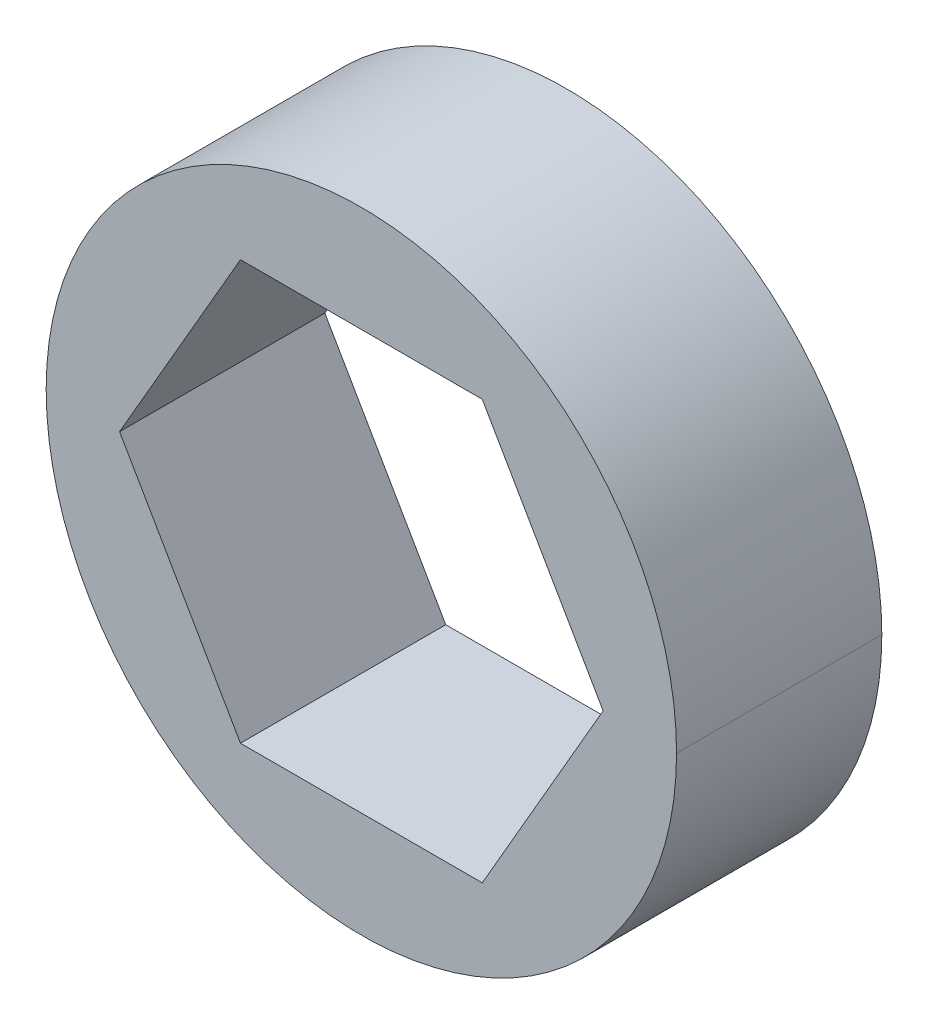
ISO-10303-21;
HEADER;
FILE_DESCRIPTION(('STEP AP214'),'2;1');
FILE_NAME('part.step','',(''),(''),'','','');
FILE_SCHEMA(('AUTOMOTIVE_DESIGN { 1 0 10303 214 1 1 1 1 }'));
ENDSEC;
DATA;
#1=APPLICATION_CONTEXT('core data for automotive mechanical design processes');
#2=APPLICATION_PROTOCOL_DEFINITION('international standard','automotive_design',2000,#1);
#3=PRODUCT_CONTEXT('',#1,'mechanical');
#4=PRODUCT('Part','Part','',(#3));
#5=PRODUCT_RELATED_PRODUCT_CATEGORY('part','',(#4));
#6=PRODUCT_DEFINITION_FORMATION('','',#4);
#7=PRODUCT_DEFINITION_CONTEXT('part definition',#1,'design');
#8=PRODUCT_DEFINITION('design','',#6,#7);
#9=PRODUCT_DEFINITION_SHAPE('','',#8);
#10=(LENGTH_UNIT() NAMED_UNIT(*) SI_UNIT(.MILLI.,.METRE.));
#11=(NAMED_UNIT(*) PLANE_ANGLE_UNIT() SI_UNIT($,.RADIAN.));
#12=(NAMED_UNIT(*) SI_UNIT($,.STERADIAN.) SOLID_ANGLE_UNIT());
#13=UNCERTAINTY_MEASURE_WITH_UNIT(LENGTH_MEASURE(1.E-05),#10,'distance_accuracy_value','');
#14=(GEOMETRIC_REPRESENTATION_CONTEXT(3) GLOBAL_UNCERTAINTY_ASSIGNED_CONTEXT((#13)) GLOBAL_UNIT_ASSIGNED_CONTEXT((#10,
#11,#12)) REPRESENTATION_CONTEXT('',''));
#15=CARTESIAN_POINT('',(0.,0.,0.));
#16=DIRECTION('',(0.,0.,1.));
#17=DIRECTION('',(1.,0.,0.));
#18=AXIS2_PLACEMENT_3D('',#15,#16,#17);
#19=CARTESIAN_POINT('',(-7.47899538708241,0.,3.175));
#20=DIRECTION('',(0.866025403784439,0.5,0.));
#21=DIRECTION('',(0.,0.,-1.));
#22=AXIS2_PLACEMENT_3D('',#19,#20,#21);
#23=PLANE('',#22);
#24=DIRECTION('',(0.5,-0.866025403784439,0.));
#25=VECTOR('',#24,1.);
#26=CARTESIAN_POINT('',(-7.47899538708241,0.,-3.175));
#27=LINE('',#26,#25);
#28=CARTESIAN_POINT('',(-7.47899538708241,0.,-3.175));
#29=VERTEX_POINT('',#28);
#30=CARTESIAN_POINT('',(-3.73949769354121,-6.477,-3.175));
#31=VERTEX_POINT('',#30);
#32=EDGE_CURVE('E102',#29,#31,#27,.T.);
#33=ORIENTED_EDGE('',*,*,#32,.F.);
#34=DIRECTION('',(0.,0.,-1.));
#35=VECTOR('',#34,1.);
#36=CARTESIAN_POINT('',(-7.47899538708241,0.,3.175));
#37=LINE('',#36,#35);
#38=CARTESIAN_POINT('',(-7.47899538708242,0.,3.175));
#39=VERTEX_POINT('',#38);
#40=EDGE_CURVE('E11',#39,#29,#37,.T.);
#41=ORIENTED_EDGE('',*,*,#40,.F.);
#42=DIRECTION('',(0.5,-0.866025403784439,0.));
#43=VECTOR('',#42,1.);
#44=CARTESIAN_POINT('',(-7.47899538708241,0.,3.175));
#45=LINE('',#44,#43);
#46=CARTESIAN_POINT('',(-3.7394976935412,-6.477,3.175));
#47=VERTEX_POINT('',#46);
#48=EDGE_CURVE('E105',#39,#47,#45,.T.);
#49=ORIENTED_EDGE('',*,*,#48,.T.);
#50=DIRECTION('',(0.,0.,-1.));
#51=VECTOR('',#50,1.);
#52=CARTESIAN_POINT('',(-3.7394976935412,-6.477,3.175));
#53=LINE('',#52,#51);
#54=EDGE_CURVE('E100',#47,#31,#53,.T.);
#55=ORIENTED_EDGE('',*,*,#54,.T.);
#56=EDGE_LOOP('',(#33,#41,#49,#55));
#57=FACE_BOUND('',#56,.T.);
#58=ADVANCED_FACE('F16',(#57),#23,.T.);
#59=CARTESIAN_POINT('',(-3.73949769354121,6.477,3.175));
#60=DIRECTION('',(0.866025403784439,-0.5,0.));
#61=DIRECTION('',(0.,0.,-1.));
#62=AXIS2_PLACEMENT_3D('',#59,#60,#61);
#63=PLANE('',#62);
#64=DIRECTION('',(-0.5,-0.866025403784439,0.));
#65=VECTOR('',#64,1.);
#66=CARTESIAN_POINT('',(-3.73949769354121,6.477,-3.175));
#67=LINE('',#66,#65);
#68=CARTESIAN_POINT('',(-3.73949769354121,6.477,-3.175));
#69=VERTEX_POINT('',#68);
#70=EDGE_CURVE('E120',#69,#29,#67,.T.);
#71=ORIENTED_EDGE('',*,*,#70,.F.);
#72=DIRECTION('',(0.,0.,-1.));
#73=VECTOR('',#72,1.);
#74=CARTESIAN_POINT('',(-3.73949769354121,6.477,3.175));
#75=LINE('',#74,#73);
#76=CARTESIAN_POINT('',(-3.73949769354121,6.477,3.175));
#77=VERTEX_POINT('',#76);
#78=EDGE_CURVE('E27',#77,#69,#75,.T.);
#79=ORIENTED_EDGE('',*,*,#78,.F.);
#80=DIRECTION('',(-0.5,-0.866025403784439,0.));
#81=VECTOR('',#80,1.);
#82=CARTESIAN_POINT('',(-3.73949769354121,6.477,3.175));
#83=LINE('',#82,#81);
#84=EDGE_CURVE('E151',#77,#39,#83,.T.);
#85=ORIENTED_EDGE('',*,*,#84,.T.);
#86=ORIENTED_EDGE('',*,*,#40,.T.);
#87=EDGE_LOOP('',(#71,#79,#85,#86));
#88=FACE_BOUND('',#87,.T.);
#89=ADVANCED_FACE('F225',(#88),#63,.T.);
#90=CARTESIAN_POINT('',(3.7394976935412,6.477,3.175));
#91=DIRECTION('',(0.,-1.,0.));
#92=DIRECTION('',(0.,0.,-1.));
#93=AXIS2_PLACEMENT_3D('',#90,#91,#92);
#94=PLANE('',#93);
#95=DIRECTION('',(-1.,0.,0.));
#96=VECTOR('',#95,1.);
#97=CARTESIAN_POINT('',(3.7394976935412,6.477,-3.175));
#98=LINE('',#97,#96);
#99=CARTESIAN_POINT('',(3.7394976935412,6.477,-3.175));
#100=VERTEX_POINT('',#99);
#101=EDGE_CURVE('E146',#100,#69,#98,.T.);
#102=ORIENTED_EDGE('',*,*,#101,.F.);
#103=DIRECTION('',(0.,0.,-1.));
#104=VECTOR('',#103,1.);
#105=CARTESIAN_POINT('',(3.7394976935412,6.477,3.175));
#106=LINE('',#105,#104);
#107=CARTESIAN_POINT('',(3.7394976935412,6.477,3.175));
#108=VERTEX_POINT('',#107);
#109=EDGE_CURVE('E144',#108,#100,#106,.T.);
#110=ORIENTED_EDGE('',*,*,#109,.F.);
#111=DIRECTION('',(-1.,0.,0.));
#112=VECTOR('',#111,1.);
#113=CARTESIAN_POINT('',(3.7394976935412,6.477,3.175));
#114=LINE('',#113,#112);
#115=EDGE_CURVE('E153',#108,#77,#114,.T.);
#116=ORIENTED_EDGE('',*,*,#115,.T.);
#117=ORIENTED_EDGE('',*,*,#78,.T.);
#118=EDGE_LOOP('',(#102,#110,#116,#117));
#119=FACE_BOUND('',#118,.T.);
#120=ADVANCED_FACE('F187',(#119),#94,.T.);
#121=CARTESIAN_POINT('',(7.47899538708241,0.,3.175));
#122=DIRECTION('',(-0.866025403784439,-0.5,0.));
#123=DIRECTION('',(-0.5,0.866025403784439,0.));
#124=AXIS2_PLACEMENT_3D('',#121,#122,#123);
#125=PLANE('',#124);
#126=DIRECTION('',(-0.5,0.866025403784439,0.));
#127=VECTOR('',#126,1.);
#128=CARTESIAN_POINT('',(7.47899538708241,0.,-3.175));
#129=LINE('',#128,#127);
#130=CARTESIAN_POINT('',(7.47899538708241,0.,-3.175));
#131=VERTEX_POINT('',#130);
#132=EDGE_CURVE('E134',#131,#100,#129,.T.);
#133=ORIENTED_EDGE('',*,*,#132,.F.);
#134=DIRECTION('',(0.,0.,-1.));
#135=VECTOR('',#134,1.);
#136=CARTESIAN_POINT('',(7.47899538708241,0.,3.175));
#137=LINE('',#136,#135);
#138=CARTESIAN_POINT('',(7.47899538708241,0.,3.175));
#139=VERTEX_POINT('',#138);
#140=EDGE_CURVE('E142',#139,#131,#137,.T.);
#141=ORIENTED_EDGE('',*,*,#140,.F.);
#142=DIRECTION('',(-0.5,0.866025403784439,0.));
#143=VECTOR('',#142,1.);
#144=CARTESIAN_POINT('',(7.47899538708241,0.,3.175));
#145=LINE('',#144,#143);
#146=EDGE_CURVE('E136',#139,#108,#145,.T.);
#147=ORIENTED_EDGE('',*,*,#146,.T.);
#148=ORIENTED_EDGE('',*,*,#109,.T.);
#149=EDGE_LOOP('',(#133,#141,#147,#148));
#150=FACE_BOUND('',#149,.T.);
#151=ADVANCED_FACE('F178',(#150),#125,.T.);
#152=CARTESIAN_POINT('',(3.7394976935412,-6.477,3.175));
#153=DIRECTION('',(-0.866025403784439,0.5,0.));
#154=DIRECTION('',(0.,0.,1.));
#155=AXIS2_PLACEMENT_3D('',#152,#153,#154);
#156=PLANE('',#155);
#157=DIRECTION('',(0.5,0.866025403784439,0.));
#158=VECTOR('',#157,1.);
#159=CARTESIAN_POINT('',(3.7394976935412,-6.477,-3.175));
#160=LINE('',#159,#158);
#161=CARTESIAN_POINT('',(3.7394976935412,-6.477,-3.175));
#162=VERTEX_POINT('',#161);
#163=EDGE_CURVE('E126',#162,#131,#160,.T.);
#164=ORIENTED_EDGE('',*,*,#163,.F.);
#165=DIRECTION('',(0.,0.,-1.));
#166=VECTOR('',#165,1.);
#167=CARTESIAN_POINT('',(3.7394976935412,-6.477,3.175));
#168=LINE('',#167,#166);
#169=CARTESIAN_POINT('',(3.7394976935412,-6.477,3.175));
#170=VERTEX_POINT('',#169);
#171=EDGE_CURVE('E111',#170,#162,#168,.T.);
#172=ORIENTED_EDGE('',*,*,#171,.F.);
#173=DIRECTION('',(0.5,0.866025403784439,0.));
#174=VECTOR('',#173,1.);
#175=CARTESIAN_POINT('',(3.7394976935412,-6.477,3.175));
#176=LINE('',#175,#174);
#177=EDGE_CURVE('E169',#170,#139,#176,.T.);
#178=ORIENTED_EDGE('',*,*,#177,.T.);
#179=ORIENTED_EDGE('',*,*,#140,.T.);
#180=EDGE_LOOP('',(#164,#172,#178,#179));
#181=FACE_BOUND('',#180,.T.);
#182=ADVANCED_FACE('F233',(#181),#156,.T.);
#183=CARTESIAN_POINT('',(-3.7394976935412,-6.477,3.175));
#184=DIRECTION('',(0.,1.,0.));
#185=DIRECTION('',(1.,0.,0.));
#186=AXIS2_PLACEMENT_3D('',#183,#184,#185);
#187=PLANE('',#186);
#188=DIRECTION('',(1.,0.,0.));
#189=VECTOR('',#188,1.);
#190=CARTESIAN_POINT('',(-3.7394976935412,-6.477,-3.175));
#191=LINE('',#190,#189);
#192=EDGE_CURVE('E118',#31,#162,#191,.T.);
#193=ORIENTED_EDGE('',*,*,#192,.F.);
#194=ORIENTED_EDGE('',*,*,#54,.F.);
#195=DIRECTION('',(1.,0.,0.));
#196=VECTOR('',#195,1.);
#197=CARTESIAN_POINT('',(-3.7394976935412,-6.477,3.175));
#198=LINE('',#197,#196);
#199=EDGE_CURVE('E152',#47,#170,#198,.T.);
#200=ORIENTED_EDGE('',*,*,#199,.T.);
#201=ORIENTED_EDGE('',*,*,#171,.T.);
#202=EDGE_LOOP('',(#193,#194,#200,#201));
#203=FACE_BOUND('',#202,.T.);
#204=ADVANCED_FACE('F123',(#203),#187,.T.);
#205=CARTESIAN_POINT('',(0.,0.,3.175));
#206=DIRECTION('',(0.,0.,-1.));
#207=DIRECTION('',(-1.,0.,0.));
#208=AXIS2_PLACEMENT_3D('',#205,#206,#207);
#209=CYLINDRICAL_SURFACE('',#208,9.75);
#210=DIRECTION('',(0.,0.,-1.));
#211=VECTOR('',#210,1.);
#212=CARTESIAN_POINT('',(9.75,0.,3.175));
#213=LINE('',#212,#211);
#214=CARTESIAN_POINT('',(9.75,0.,3.175));
#215=VERTEX_POINT('',#214);
#216=CARTESIAN_POINT('',(9.75,0.,-3.175));
#217=VERTEX_POINT('',#216);
#218=EDGE_CURVE('E20',#215,#217,#213,.T.);
#219=ORIENTED_EDGE('',*,*,#218,.F.);
#220=CARTESIAN_POINT('',(0.,0.,3.175));
#221=DIRECTION('',(0.,0.,1.));
#222=DIRECTION('',(1.,0.,0.));
#223=AXIS2_PLACEMENT_3D('',#220,#221,#222);
#224=CIRCLE('',#223,9.75);
#225=CARTESIAN_POINT('',(-9.75,0.,3.175));
#226=VERTEX_POINT('',#225);
#227=EDGE_CURVE('E195',#226,#215,#224,.T.);
#228=ORIENTED_EDGE('',*,*,#227,.F.);
#229=DIRECTION('',(0.,0.,-1.));
#230=VECTOR('',#229,1.);
#231=CARTESIAN_POINT('',(-9.75,0.,3.175));
#232=LINE('',#231,#230);
#233=CARTESIAN_POINT('',(-9.75,0.,-3.175));
#234=VERTEX_POINT('',#233);
#235=EDGE_CURVE('E167',#226,#234,#232,.T.);
#236=ORIENTED_EDGE('',*,*,#235,.T.);
#237=CARTESIAN_POINT('',(0.,0.,-3.175));
#238=DIRECTION('',(0.,0.,1.));
#239=DIRECTION('',(1.,0.,0.));
#240=AXIS2_PLACEMENT_3D('',#237,#238,#239);
#241=CIRCLE('',#240,9.75);
#242=EDGE_CURVE('E127',#234,#217,#241,.T.);
#243=ORIENTED_EDGE('',*,*,#242,.T.);
#244=EDGE_LOOP('',(#219,#228,#236,#243));
#245=FACE_BOUND('',#244,.T.);
#246=ADVANCED_FACE('F18',(#245),#209,.T.);
#247=CARTESIAN_POINT('',(0.,0.,-3.175));
#248=DIRECTION('',(0.,0.,1.));
#249=DIRECTION('',(1.,0.,0.));
#250=AXIS2_PLACEMENT_3D('',#247,#248,#249);
#251=PLANE('',#250);
#252=ORIENTED_EDGE('',*,*,#192,.T.);
#253=ORIENTED_EDGE('',*,*,#163,.T.);
#254=ORIENTED_EDGE('',*,*,#132,.T.);
#255=ORIENTED_EDGE('',*,*,#101,.T.);
#256=ORIENTED_EDGE('',*,*,#70,.T.);
#257=ORIENTED_EDGE('',*,*,#32,.T.);
#258=EDGE_LOOP('',(#252,#253,#254,#255,#256,#257));
#259=FACE_BOUND('',#258,.T.);
#260=ORIENTED_EDGE('',*,*,#242,.F.);
#261=CARTESIAN_POINT('',(0.,0.,-3.175));
#262=DIRECTION('',(0.,0.,1.));
#263=DIRECTION('',(1.,0.,0.));
#264=AXIS2_PLACEMENT_3D('',#261,#262,#263);
#265=CIRCLE('',#264,9.75);
#266=EDGE_CURVE('E163',#217,#234,#265,.T.);
#267=ORIENTED_EDGE('',*,*,#266,.F.);
#268=EDGE_LOOP('',(#260,#267));
#269=FACE_BOUND('',#268,.T.);
#270=ADVANCED_FACE('F115',(#259,#269),#251,.F.);
#271=CARTESIAN_POINT('',(0.,0.,3.175));
#272=DIRECTION('',(0.,0.,1.));
#273=DIRECTION('',(1.,0.,0.));
#274=AXIS2_PLACEMENT_3D('',#271,#272,#273);
#275=PLANE('',#274);
#276=ORIENTED_EDGE('',*,*,#177,.F.);
#277=ORIENTED_EDGE('',*,*,#199,.F.);
#278=ORIENTED_EDGE('',*,*,#48,.F.);
#279=ORIENTED_EDGE('',*,*,#84,.F.);
#280=ORIENTED_EDGE('',*,*,#115,.F.);
#281=ORIENTED_EDGE('',*,*,#146,.F.);
#282=EDGE_LOOP('',(#276,#277,#278,#279,#280,#281));
#283=FACE_BOUND('',#282,.T.);
#284=ORIENTED_EDGE('',*,*,#227,.T.);
#285=CARTESIAN_POINT('',(0.,0.,3.175));
#286=DIRECTION('',(0.,0.,1.));
#287=DIRECTION('',(1.,0.,0.));
#288=AXIS2_PLACEMENT_3D('',#285,#286,#287);
#289=CIRCLE('',#288,9.75);
#290=EDGE_CURVE('E197',#215,#226,#289,.T.);
#291=ORIENTED_EDGE('',*,*,#290,.T.);
#292=EDGE_LOOP('',(#284,#291));
#293=FACE_BOUND('',#292,.T.);
#294=ADVANCED_FACE('F184',(#283,#293),#275,.T.);
#295=CARTESIAN_POINT('',(0.,0.,3.175));
#296=DIRECTION('',(0.,0.,-1.));
#297=DIRECTION('',(-1.,0.,0.));
#298=AXIS2_PLACEMENT_3D('',#295,#296,#297);
#299=CYLINDRICAL_SURFACE('',#298,9.75);
#300=ORIENTED_EDGE('',*,*,#290,.F.);
#301=ORIENTED_EDGE('',*,*,#218,.T.);
#302=ORIENTED_EDGE('',*,*,#266,.T.);
#303=ORIENTED_EDGE('',*,*,#235,.F.);
#304=EDGE_LOOP('',(#300,#301,#302,#303));
#305=FACE_BOUND('',#304,.T.);
#306=ADVANCED_FACE('F209',(#305),#299,.T.);
#307=CLOSED_SHELL('',(#58,#89,#120,#151,#182,#204,#246,#270,#294,#306));
#308=MANIFOLD_SOLID_BREP('B1',#307);
#309=ADVANCED_BREP_SHAPE_REPRESENTATION('',(#18,#308),#14);
#310=SHAPE_DEFINITION_REPRESENTATION(#9,#309);
ENDSEC;
END-ISO-10303-21;
